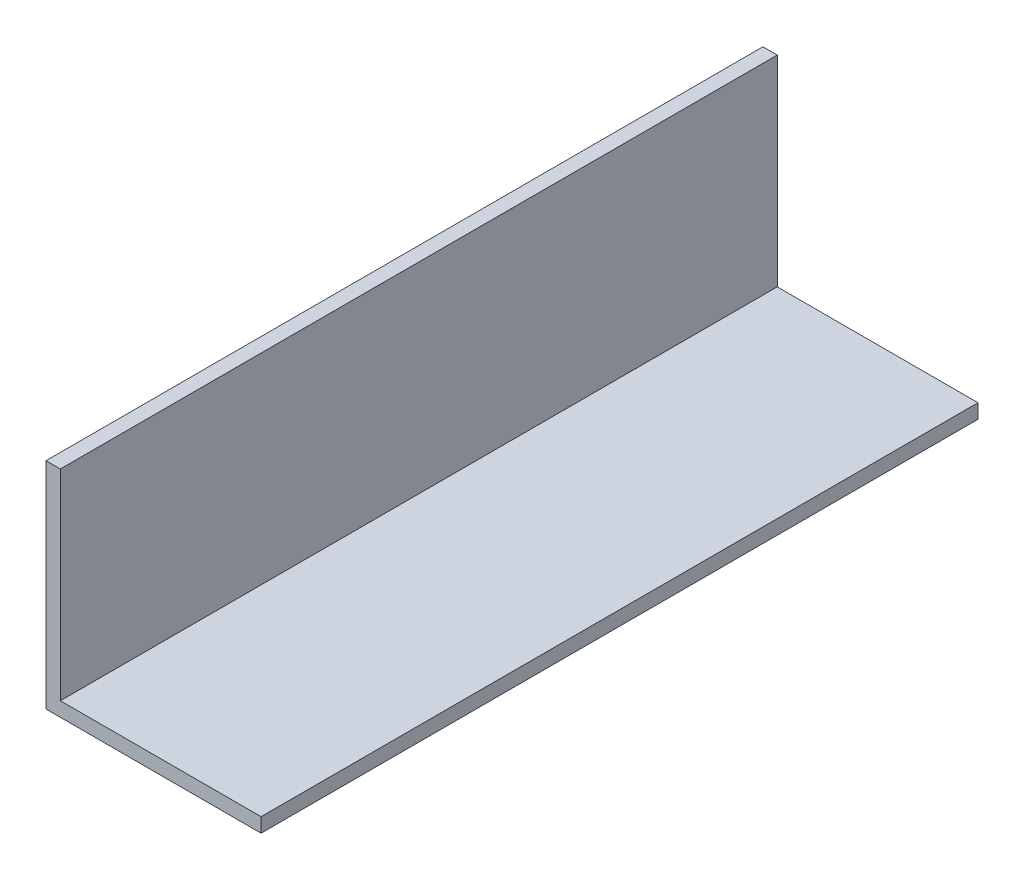
ISO-10303-21;
HEADER;
FILE_DESCRIPTION(('STEP AP214'),'2;1');
FILE_NAME('part.step','',(''),(''),'','','');
FILE_SCHEMA(('AUTOMOTIVE_DESIGN { 1 0 10303 214 1 1 1 1 }'));
ENDSEC;
DATA;
#1=APPLICATION_CONTEXT('core data for automotive mechanical design processes');
#2=APPLICATION_PROTOCOL_DEFINITION('international standard','automotive_design',2000,#1);
#3=PRODUCT_CONTEXT('',#1,'mechanical');
#4=PRODUCT('Part','Part','',(#3));
#5=PRODUCT_RELATED_PRODUCT_CATEGORY('part','',(#4));
#6=PRODUCT_DEFINITION_FORMATION('','',#4);
#7=PRODUCT_DEFINITION_CONTEXT('part definition',#1,'design');
#8=PRODUCT_DEFINITION('design','',#6,#7);
#9=PRODUCT_DEFINITION_SHAPE('','',#8);
#10=(LENGTH_UNIT() NAMED_UNIT(*) SI_UNIT(.MILLI.,.METRE.));
#11=(NAMED_UNIT(*) PLANE_ANGLE_UNIT() SI_UNIT($,.RADIAN.));
#12=(NAMED_UNIT(*) SI_UNIT($,.STERADIAN.) SOLID_ANGLE_UNIT());
#13=UNCERTAINTY_MEASURE_WITH_UNIT(LENGTH_MEASURE(1.E-05),#10,'distance_accuracy_value','');
#14=(GEOMETRIC_REPRESENTATION_CONTEXT(3) GLOBAL_UNCERTAINTY_ASSIGNED_CONTEXT((#13)) GLOBAL_UNIT_ASSIGNED_CONTEXT((#10,
#11,#12)) REPRESENTATION_CONTEXT('',''));
#15=CARTESIAN_POINT('',(0.,0.,0.));
#16=DIRECTION('',(0.,0.,1.));
#17=DIRECTION('',(1.,0.,0.));
#18=AXIS2_PLACEMENT_3D('',#15,#16,#17);
#19=CARTESIAN_POINT('',(-4.46145577395577,0.,50.));
#20=DIRECTION('',(1.,0.,0.));
#21=DIRECTION('',(0.,1.,0.));
#22=AXIS2_PLACEMENT_3D('',#19,#20,#21);
#23=PLANE('',#22);
#24=DIRECTION('',(0.,-1.,0.));
#25=VECTOR('',#24,1.);
#26=CARTESIAN_POINT('',(-4.46145577395577,0.,0.));
#27=LINE('',#26,#25);
#28=CARTESIAN_POINT('',(-4.46145577395577,6.35330578512397,0.));
#29=VERTEX_POINT('',#28);
#30=CARTESIAN_POINT('',(-4.46145577395577,-7.64669421487603,0.));
#31=VERTEX_POINT('',#30);
#32=EDGE_CURVE('E116',#29,#31,#27,.T.);
#33=ORIENTED_EDGE('',*,*,#32,.F.);
#34=DIRECTION('',(0.,0.,-1.));
#35=VECTOR('',#34,1.);
#36=CARTESIAN_POINT('',(-4.46145577395577,6.35330578512397,50.));
#37=LINE('',#36,#35);
#38=CARTESIAN_POINT('',(-4.46145577395577,6.35330578512397,50.));
#39=VERTEX_POINT('',#38);
#40=EDGE_CURVE('E11',#39,#29,#37,.T.);
#41=ORIENTED_EDGE('',*,*,#40,.F.);
#42=DIRECTION('',(0.,-1.,0.));
#43=VECTOR('',#42,1.);
#44=CARTESIAN_POINT('',(-4.46145577395577,0.,50.));
#45=LINE('',#44,#43);
#46=CARTESIAN_POINT('',(-4.46145577395577,-7.64669421487603,50.));
#47=VERTEX_POINT('',#46);
#48=EDGE_CURVE('E129',#39,#47,#45,.T.);
#49=ORIENTED_EDGE('',*,*,#48,.T.);
#50=DIRECTION('',(0.,0.,-1.));
#51=VECTOR('',#50,1.);
#52=CARTESIAN_POINT('',(-4.46145577395577,-7.64669421487603,50.));
#53=LINE('',#52,#51);
#54=EDGE_CURVE('E78',#47,#31,#53,.T.);
#55=ORIENTED_EDGE('',*,*,#54,.T.);
#56=EDGE_LOOP('',(#33,#41,#49,#55));
#57=FACE_BOUND('',#56,.T.);
#58=ADVANCED_FACE('F34',(#57),#23,.T.);
#59=CARTESIAN_POINT('',(0.,6.35330578512397,50.));
#60=DIRECTION('',(0.,1.,0.));
#61=DIRECTION('',(-1.,0.,0.));
#62=AXIS2_PLACEMENT_3D('',#59,#60,#61);
#63=PLANE('',#62);
#64=DIRECTION('',(1.,0.,0.));
#65=VECTOR('',#64,1.);
#66=CARTESIAN_POINT('',(0.,6.35330578512397,0.));
#67=LINE('',#66,#65);
#68=CARTESIAN_POINT('',(-5.46145577395577,6.35330578512397,0.));
#69=VERTEX_POINT('',#68);
#70=EDGE_CURVE('E119',#69,#29,#67,.T.);
#71=ORIENTED_EDGE('',*,*,#70,.F.);
#72=DIRECTION('',(0.,0.,-1.));
#73=VECTOR('',#72,1.);
#74=CARTESIAN_POINT('',(-5.46145577395577,6.35330578512397,50.));
#75=LINE('',#74,#73);
#76=CARTESIAN_POINT('',(-5.46145577395577,6.35330578512397,50.));
#77=VERTEX_POINT('',#76);
#78=EDGE_CURVE('E42',#77,#69,#75,.T.);
#79=ORIENTED_EDGE('',*,*,#78,.F.);
#80=DIRECTION('',(1.,0.,0.));
#81=VECTOR('',#80,1.);
#82=CARTESIAN_POINT('',(0.,6.35330578512397,50.));
#83=LINE('',#82,#81);
#84=EDGE_CURVE('E141',#77,#39,#83,.T.);
#85=ORIENTED_EDGE('',*,*,#84,.T.);
#86=ORIENTED_EDGE('',*,*,#40,.T.);
#87=EDGE_LOOP('',(#71,#79,#85,#86));
#88=FACE_BOUND('',#87,.T.);
#89=ADVANCED_FACE('F140',(#88),#63,.T.);
#90=CARTESIAN_POINT('',(-5.46145577395577,0.,50.));
#91=DIRECTION('',(1.,0.,0.));
#92=DIRECTION('',(0.,0.,-1.));
#93=AXIS2_PLACEMENT_3D('',#90,#91,#92);
#94=PLANE('',#93);
#95=DIRECTION('',(0.,-1.,0.));
#96=VECTOR('',#95,1.);
#97=CARTESIAN_POINT('',(-5.46145577395577,0.,0.));
#98=LINE('',#97,#96);
#99=CARTESIAN_POINT('',(-5.46145577395577,-8.64669421487603,0.));
#100=VERTEX_POINT('',#99);
#101=EDGE_CURVE('E122',#69,#100,#98,.T.);
#102=ORIENTED_EDGE('',*,*,#101,.T.);
#103=DIRECTION('',(0.,0.,-1.));
#104=VECTOR('',#103,1.);
#105=CARTESIAN_POINT('',(-5.46145577395577,-8.64669421487603,50.));
#106=LINE('',#105,#104);
#107=CARTESIAN_POINT('',(-5.46145577395577,-8.64669421487603,50.));
#108=VERTEX_POINT('',#107);
#109=EDGE_CURVE('E109',#108,#100,#106,.T.);
#110=ORIENTED_EDGE('',*,*,#109,.F.);
#111=DIRECTION('',(0.,-1.,0.));
#112=VECTOR('',#111,1.);
#113=CARTESIAN_POINT('',(-5.46145577395577,0.,50.));
#114=LINE('',#113,#112);
#115=EDGE_CURVE('E96',#77,#108,#114,.T.);
#116=ORIENTED_EDGE('',*,*,#115,.F.);
#117=ORIENTED_EDGE('',*,*,#78,.T.);
#118=EDGE_LOOP('',(#102,#110,#116,#117));
#119=FACE_BOUND('',#118,.T.);
#120=ADVANCED_FACE('F134',(#119),#94,.F.);
#121=CARTESIAN_POINT('',(0.,-8.64669421487603,50.));
#122=DIRECTION('',(0.,1.,0.));
#123=DIRECTION('',(0.,0.,1.));
#124=AXIS2_PLACEMENT_3D('',#121,#122,#123);
#125=PLANE('',#124);
#126=DIRECTION('',(1.,0.,0.));
#127=VECTOR('',#126,1.);
#128=CARTESIAN_POINT('',(0.,-8.64669421487603,0.));
#129=LINE('',#128,#127);
#130=CARTESIAN_POINT('',(9.53854422604423,-8.64669421487603,0.));
#131=VERTEX_POINT('',#130);
#132=EDGE_CURVE('E105',#100,#131,#129,.T.);
#133=ORIENTED_EDGE('',*,*,#132,.T.);
#134=DIRECTION('',(0.,0.,-1.));
#135=VECTOR('',#134,1.);
#136=CARTESIAN_POINT('',(9.53854422604423,-8.64669421487603,50.));
#137=LINE('',#136,#135);
#138=CARTESIAN_POINT('',(9.53854422604423,-8.64669421487603,50.));
#139=VERTEX_POINT('',#138);
#140=EDGE_CURVE('E102',#139,#131,#137,.T.);
#141=ORIENTED_EDGE('',*,*,#140,.F.);
#142=DIRECTION('',(1.,0.,0.));
#143=VECTOR('',#142,1.);
#144=CARTESIAN_POINT('',(0.,-8.64669421487603,50.));
#145=LINE('',#144,#143);
#146=EDGE_CURVE('E89',#108,#139,#145,.T.);
#147=ORIENTED_EDGE('',*,*,#146,.F.);
#148=ORIENTED_EDGE('',*,*,#109,.T.);
#149=EDGE_LOOP('',(#133,#141,#147,#148));
#150=FACE_BOUND('',#149,.T.);
#151=ADVANCED_FACE('F103',(#150),#125,.F.);
#152=CARTESIAN_POINT('',(9.53854422604423,0.,50.));
#153=DIRECTION('',(1.,0.,0.));
#154=DIRECTION('',(0.,1.,0.));
#155=AXIS2_PLACEMENT_3D('',#152,#153,#154);
#156=PLANE('',#155);
#157=DIRECTION('',(0.,-1.,0.));
#158=VECTOR('',#157,1.);
#159=CARTESIAN_POINT('',(9.53854422604423,0.,0.));
#160=LINE('',#159,#158);
#161=CARTESIAN_POINT('',(9.53854422604423,-7.64669421487603,0.));
#162=VERTEX_POINT('',#161);
#163=EDGE_CURVE('E125',#162,#131,#160,.T.);
#164=ORIENTED_EDGE('',*,*,#163,.F.);
#165=DIRECTION('',(0.,0.,-1.));
#166=VECTOR('',#165,1.);
#167=CARTESIAN_POINT('',(9.53854422604423,-7.64669421487603,50.));
#168=LINE('',#167,#166);
#169=CARTESIAN_POINT('',(9.53854422604423,-7.64669421487603,50.));
#170=VERTEX_POINT('',#169);
#171=EDGE_CURVE('E71',#170,#162,#168,.T.);
#172=ORIENTED_EDGE('',*,*,#171,.F.);
#173=DIRECTION('',(0.,-1.,0.));
#174=VECTOR('',#173,1.);
#175=CARTESIAN_POINT('',(9.53854422604423,0.,50.));
#176=LINE('',#175,#174);
#177=EDGE_CURVE('E93',#170,#139,#176,.T.);
#178=ORIENTED_EDGE('',*,*,#177,.T.);
#179=ORIENTED_EDGE('',*,*,#140,.T.);
#180=EDGE_LOOP('',(#164,#172,#178,#179));
#181=FACE_BOUND('',#180,.T.);
#182=ADVANCED_FACE('F111',(#181),#156,.T.);
#183=CARTESIAN_POINT('',(0.,-7.64669421487603,50.));
#184=DIRECTION('',(0.,-1.,0.));
#185=DIRECTION('',(1.,0.,0.));
#186=AXIS2_PLACEMENT_3D('',#183,#184,#185);
#187=PLANE('',#186);
#188=DIRECTION('',(-1.,0.,0.));
#189=VECTOR('',#188,1.);
#190=CARTESIAN_POINT('',(0.,-7.64669421487603,0.));
#191=LINE('',#190,#189);
#192=EDGE_CURVE('E127',#162,#31,#191,.T.);
#193=ORIENTED_EDGE('',*,*,#192,.T.);
#194=ORIENTED_EDGE('',*,*,#54,.F.);
#195=DIRECTION('',(-1.,0.,0.));
#196=VECTOR('',#195,1.);
#197=CARTESIAN_POINT('',(0.,-7.64669421487603,50.));
#198=LINE('',#197,#196);
#199=EDGE_CURVE('E50',#170,#47,#198,.T.);
#200=ORIENTED_EDGE('',*,*,#199,.F.);
#201=ORIENTED_EDGE('',*,*,#171,.T.);
#202=EDGE_LOOP('',(#193,#194,#200,#201));
#203=FACE_BOUND('',#202,.T.);
#204=ADVANCED_FACE('F142',(#203),#187,.F.);
#205=CARTESIAN_POINT('',(0.,0.,50.));
#206=DIRECTION('',(0.,0.,1.));
#207=DIRECTION('',(1.,0.,0.));
#208=AXIS2_PLACEMENT_3D('',#205,#206,#207);
#209=PLANE('',#208);
#210=ORIENTED_EDGE('',*,*,#48,.F.);
#211=ORIENTED_EDGE('',*,*,#84,.F.);
#212=ORIENTED_EDGE('',*,*,#115,.T.);
#213=ORIENTED_EDGE('',*,*,#146,.T.);
#214=ORIENTED_EDGE('',*,*,#177,.F.);
#215=ORIENTED_EDGE('',*,*,#199,.T.);
#216=EDGE_LOOP('',(#210,#211,#212,#213,#214,#215));
#217=FACE_BOUND('',#216,.T.);
#218=ADVANCED_FACE('F91',(#217),#209,.T.);
#219=CARTESIAN_POINT('',(0.,0.,0.));
#220=DIRECTION('',(0.,0.,1.));
#221=DIRECTION('',(1.,0.,0.));
#222=AXIS2_PLACEMENT_3D('',#219,#220,#221);
#223=PLANE('',#222);
#224=ORIENTED_EDGE('',*,*,#32,.T.);
#225=ORIENTED_EDGE('',*,*,#192,.F.);
#226=ORIENTED_EDGE('',*,*,#163,.T.);
#227=ORIENTED_EDGE('',*,*,#132,.F.);
#228=ORIENTED_EDGE('',*,*,#101,.F.);
#229=ORIENTED_EDGE('',*,*,#70,.T.);
#230=EDGE_LOOP('',(#224,#225,#226,#227,#228,#229));
#231=FACE_BOUND('',#230,.T.);
#232=ADVANCED_FACE('F139',(#231),#223,.F.);
#233=CLOSED_SHELL('',(#58,#89,#120,#151,#182,#204,#218,#232));
#234=MANIFOLD_SOLID_BREP('B2',#233);
#235=ADVANCED_BREP_SHAPE_REPRESENTATION('',(#18,#234),#14);
#236=SHAPE_DEFINITION_REPRESENTATION(#9,#235);
ENDSEC;
END-ISO-10303-21;
